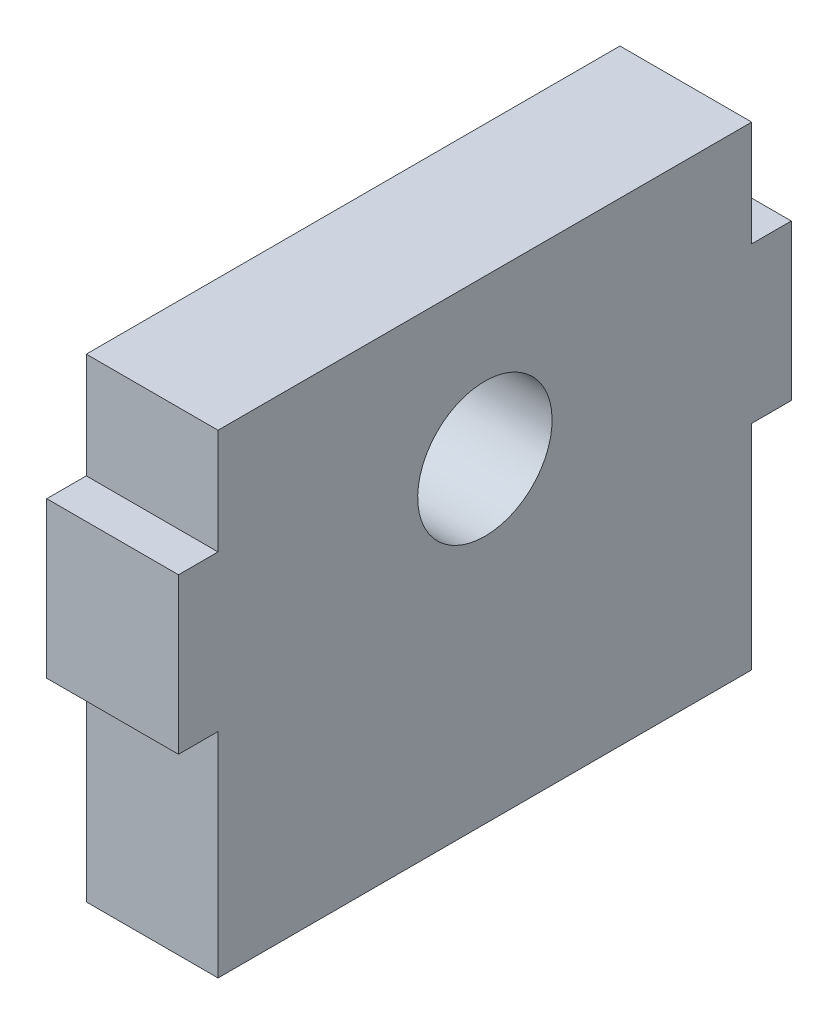
ISO-10303-21;
HEADER;
FILE_DESCRIPTION(('STEP AP214'),'2;1');
FILE_NAME('part.step','',(''),(''),'','','');
FILE_SCHEMA(('AUTOMOTIVE_DESIGN { 1 0 10303 214 1 1 1 1 }'));
ENDSEC;
DATA;
#1=APPLICATION_CONTEXT('core data for automotive mechanical design processes');
#2=APPLICATION_PROTOCOL_DEFINITION('international standard','automotive_design',2000,#1);
#3=PRODUCT_CONTEXT('',#1,'mechanical');
#4=PRODUCT('Part','Part','',(#3));
#5=PRODUCT_RELATED_PRODUCT_CATEGORY('part','',(#4));
#6=PRODUCT_DEFINITION_FORMATION('','',#4);
#7=PRODUCT_DEFINITION_CONTEXT('part definition',#1,'design');
#8=PRODUCT_DEFINITION('design','',#6,#7);
#9=PRODUCT_DEFINITION_SHAPE('','',#8);
#10=(LENGTH_UNIT() NAMED_UNIT(*) SI_UNIT(.MILLI.,.METRE.));
#11=(NAMED_UNIT(*) PLANE_ANGLE_UNIT() SI_UNIT($,.RADIAN.));
#12=(NAMED_UNIT(*) SI_UNIT($,.STERADIAN.) SOLID_ANGLE_UNIT());
#13=UNCERTAINTY_MEASURE_WITH_UNIT(LENGTH_MEASURE(1.E-05),#10,'distance_accuracy_value','');
#14=(GEOMETRIC_REPRESENTATION_CONTEXT(3) GLOBAL_UNCERTAINTY_ASSIGNED_CONTEXT((#13)) GLOBAL_UNIT_ASSIGNED_CONTEXT((#10,
#11,#12)) REPRESENTATION_CONTEXT('',''));
#15=CARTESIAN_POINT('',(0.,0.,0.));
#16=DIRECTION('',(0.,0.,1.));
#17=DIRECTION('',(1.,0.,0.));
#18=AXIS2_PLACEMENT_3D('',#15,#16,#17);
#19=CARTESIAN_POINT('',(-49.5,0.,48.5));
#20=DIRECTION('',(0.,0.,-1.));
#21=DIRECTION('',(0.,-1.,0.));
#22=AXIS2_PLACEMENT_3D('',#19,#20,#21);
#23=PLANE('',#22);
#24=DIRECTION('',(1.,0.,0.));
#25=VECTOR('',#24,1.);
#26=CARTESIAN_POINT('',(-49.5,-14.,48.5));
#27=LINE('',#26,#25);
#28=CARTESIAN_POINT('',(-59.5,-14.,48.5));
#29=VERTEX_POINT('',#28);
#30=CARTESIAN_POINT('',(-49.5,-14.,48.5));
#31=VERTEX_POINT('',#30);
#32=EDGE_CURVE('E11',#29,#31,#27,.T.);
#33=ORIENTED_EDGE('',*,*,#32,.F.);
#34=DIRECTION('',(0.,-1.,0.));
#35=VECTOR('',#34,1.);
#36=CARTESIAN_POINT('',(-59.5,0.,48.5));
#37=LINE('',#36,#35);
#38=CARTESIAN_POINT('',(-59.5,-25.8,48.5));
#39=VERTEX_POINT('',#38);
#40=EDGE_CURVE('E118',#29,#39,#37,.T.);
#41=ORIENTED_EDGE('',*,*,#40,.T.);
#42=DIRECTION('',(1.,0.,0.));
#43=VECTOR('',#42,1.);
#44=CARTESIAN_POINT('',(-49.5,-25.8,48.5));
#45=LINE('',#44,#43);
#46=CARTESIAN_POINT('',(-49.5,-25.8,48.5));
#47=VERTEX_POINT('',#46);
#48=EDGE_CURVE('E49',#39,#47,#45,.T.);
#49=ORIENTED_EDGE('',*,*,#48,.T.);
#50=DIRECTION('',(0.,-1.,0.));
#51=VECTOR('',#50,1.);
#52=CARTESIAN_POINT('',(-49.5,0.,48.5));
#53=LINE('',#52,#51);
#54=EDGE_CURVE('E182',#31,#47,#53,.T.);
#55=ORIENTED_EDGE('',*,*,#54,.F.);
#56=EDGE_LOOP('',(#33,#41,#49,#55));
#57=FACE_BOUND('',#56,.T.);
#58=ADVANCED_FACE('F39',(#57),#23,.F.);
#59=CARTESIAN_POINT('',(-49.5,-25.8,0.));
#60=DIRECTION('',(0.,-1.,0.));
#61=DIRECTION('',(0.,0.,1.));
#62=AXIS2_PLACEMENT_3D('',#59,#60,#61);
#63=PLANE('',#62);
#64=ORIENTED_EDGE('',*,*,#48,.F.);
#65=DIRECTION('',(0.,0.,1.));
#66=VECTOR('',#65,1.);
#67=CARTESIAN_POINT('',(-59.5,-25.8,0.));
#68=LINE('',#67,#66);
#69=CARTESIAN_POINT('',(-59.5,-25.8,45.5));
#70=VERTEX_POINT('',#69);
#71=EDGE_CURVE('E151',#70,#39,#68,.T.);
#72=ORIENTED_EDGE('',*,*,#71,.F.);
#73=DIRECTION('',(1.,0.,0.));
#74=VECTOR('',#73,1.);
#75=CARTESIAN_POINT('',(-49.5,-25.8,45.5));
#76=LINE('',#75,#74);
#77=CARTESIAN_POINT('',(-49.5,-25.8,45.5));
#78=VERTEX_POINT('',#77);
#79=EDGE_CURVE('E175',#70,#78,#76,.T.);
#80=ORIENTED_EDGE('',*,*,#79,.T.);
#81=DIRECTION('',(0.,0.,1.));
#82=VECTOR('',#81,1.);
#83=CARTESIAN_POINT('',(-49.5,-25.8,0.));
#84=LINE('',#83,#82);
#85=EDGE_CURVE('E192',#78,#47,#84,.T.);
#86=ORIENTED_EDGE('',*,*,#85,.T.);
#87=EDGE_LOOP('',(#64,#72,#80,#86));
#88=FACE_BOUND('',#87,.T.);
#89=ADVANCED_FACE('F195',(#88),#63,.T.);
#90=CARTESIAN_POINT('',(-49.5,0.,45.5));
#91=DIRECTION('',(0.,0.,-1.));
#92=DIRECTION('',(0.,-1.,0.));
#93=AXIS2_PLACEMENT_3D('',#90,#91,#92);
#94=PLANE('',#93);
#95=ORIENTED_EDGE('',*,*,#79,.F.);
#96=DIRECTION('',(0.,-1.,0.));
#97=VECTOR('',#96,1.);
#98=CARTESIAN_POINT('',(-59.5,0.,45.5));
#99=LINE('',#98,#97);
#100=CARTESIAN_POINT('',(-59.5,-42.,45.5));
#101=VERTEX_POINT('',#100);
#102=EDGE_CURVE('E148',#70,#101,#99,.T.);
#103=ORIENTED_EDGE('',*,*,#102,.T.);
#104=DIRECTION('',(1.,0.,0.));
#105=VECTOR('',#104,1.);
#106=CARTESIAN_POINT('',(-49.5,-42.,45.5));
#107=LINE('',#106,#105);
#108=CARTESIAN_POINT('',(-49.5,-42.,45.5));
#109=VERTEX_POINT('',#108);
#110=EDGE_CURVE('E172',#101,#109,#107,.T.);
#111=ORIENTED_EDGE('',*,*,#110,.T.);
#112=DIRECTION('',(0.,-1.,0.));
#113=VECTOR('',#112,1.);
#114=CARTESIAN_POINT('',(-49.5,0.,45.5));
#115=LINE('',#114,#113);
#116=EDGE_CURVE('E196',#78,#109,#115,.T.);
#117=ORIENTED_EDGE('',*,*,#116,.F.);
#118=EDGE_LOOP('',(#95,#103,#111,#117));
#119=FACE_BOUND('',#118,.T.);
#120=ADVANCED_FACE('F254',(#119),#94,.F.);
#121=CARTESIAN_POINT('',(-49.5,-42.,0.));
#122=DIRECTION('',(0.,-1.,0.));
#123=DIRECTION('',(0.,0.,1.));
#124=AXIS2_PLACEMENT_3D('',#121,#122,#123);
#125=PLANE('',#124);
#126=ORIENTED_EDGE('',*,*,#110,.F.);
#127=DIRECTION('',(0.,0.,1.));
#128=VECTOR('',#127,1.);
#129=CARTESIAN_POINT('',(-59.5,-42.,0.));
#130=LINE('',#129,#128);
#131=CARTESIAN_POINT('',(-59.5,-42.,5.));
#132=VERTEX_POINT('',#131);
#133=EDGE_CURVE('E145',#132,#101,#130,.T.);
#134=ORIENTED_EDGE('',*,*,#133,.F.);
#135=DIRECTION('',(1.,0.,0.));
#136=VECTOR('',#135,1.);
#137=CARTESIAN_POINT('',(-49.5,-42.,5.));
#138=LINE('',#137,#136);
#139=CARTESIAN_POINT('',(-49.5,-42.,5.));
#140=VERTEX_POINT('',#139);
#141=EDGE_CURVE('E169',#132,#140,#138,.T.);
#142=ORIENTED_EDGE('',*,*,#141,.T.);
#143=DIRECTION('',(0.,0.,1.));
#144=VECTOR('',#143,1.);
#145=CARTESIAN_POINT('',(-49.5,-42.,0.));
#146=LINE('',#145,#144);
#147=EDGE_CURVE('E198',#140,#109,#146,.T.);
#148=ORIENTED_EDGE('',*,*,#147,.T.);
#149=EDGE_LOOP('',(#126,#134,#142,#148));
#150=FACE_BOUND('',#149,.T.);
#151=ADVANCED_FACE('F258',(#150),#125,.T.);
#152=CARTESIAN_POINT('',(-49.5,0.,5.));
#153=DIRECTION('',(0.,0.,-1.));
#154=DIRECTION('',(0.,-1.,0.));
#155=AXIS2_PLACEMENT_3D('',#152,#153,#154);
#156=PLANE('',#155);
#157=ORIENTED_EDGE('',*,*,#141,.F.);
#158=DIRECTION('',(0.,-1.,0.));
#159=VECTOR('',#158,1.);
#160=CARTESIAN_POINT('',(-59.5,0.,5.));
#161=LINE('',#160,#159);
#162=CARTESIAN_POINT('',(-59.5,-25.8,5.));
#163=VERTEX_POINT('',#162);
#164=EDGE_CURVE('E142',#163,#132,#161,.T.);
#165=ORIENTED_EDGE('',*,*,#164,.F.);
#166=DIRECTION('',(1.,0.,0.));
#167=VECTOR('',#166,1.);
#168=CARTESIAN_POINT('',(-49.5,-25.8,5.));
#169=LINE('',#168,#167);
#170=CARTESIAN_POINT('',(-49.5,-25.8,5.));
#171=VERTEX_POINT('',#170);
#172=EDGE_CURVE('E166',#163,#171,#169,.T.);
#173=ORIENTED_EDGE('',*,*,#172,.T.);
#174=DIRECTION('',(0.,-1.,0.));
#175=VECTOR('',#174,1.);
#176=CARTESIAN_POINT('',(-49.5,0.,5.));
#177=LINE('',#176,#175);
#178=EDGE_CURVE('E205',#171,#140,#177,.T.);
#179=ORIENTED_EDGE('',*,*,#178,.T.);
#180=EDGE_LOOP('',(#157,#165,#173,#179));
#181=FACE_BOUND('',#180,.T.);
#182=ADVANCED_FACE('F259',(#181),#156,.T.);
#183=CARTESIAN_POINT('',(-49.5,-25.8,0.));
#184=DIRECTION('',(0.,1.,0.));
#185=DIRECTION('',(0.,0.,-1.));
#186=AXIS2_PLACEMENT_3D('',#183,#184,#185);
#187=PLANE('',#186);
#188=ORIENTED_EDGE('',*,*,#172,.F.);
#189=DIRECTION('',(0.,0.,1.));
#190=VECTOR('',#189,1.);
#191=CARTESIAN_POINT('',(-59.5,-25.8,0.));
#192=LINE('',#191,#190);
#193=CARTESIAN_POINT('',(-59.5,-25.8,2.));
#194=VERTEX_POINT('',#193);
#195=EDGE_CURVE('E139',#163,#194,#192,.F.);
#196=ORIENTED_EDGE('',*,*,#195,.T.);
#197=DIRECTION('',(1.,0.,0.));
#198=VECTOR('',#197,1.);
#199=CARTESIAN_POINT('',(-49.5,-25.8,2.));
#200=LINE('',#199,#198);
#201=CARTESIAN_POINT('',(-49.5,-25.8,2.));
#202=VERTEX_POINT('',#201);
#203=EDGE_CURVE('E163',#194,#202,#200,.T.);
#204=ORIENTED_EDGE('',*,*,#203,.T.);
#205=DIRECTION('',(0.,0.,-1.));
#206=VECTOR('',#205,1.);
#207=CARTESIAN_POINT('',(-49.5,-25.8,0.));
#208=LINE('',#207,#206);
#209=EDGE_CURVE('E208',#171,#202,#208,.T.);
#210=ORIENTED_EDGE('',*,*,#209,.F.);
#211=EDGE_LOOP('',(#188,#196,#204,#210));
#212=FACE_BOUND('',#211,.T.);
#213=ADVANCED_FACE('F241',(#212),#187,.F.);
#214=CARTESIAN_POINT('',(-49.5,0.,2.));
#215=DIRECTION('',(0.,0.,-1.));
#216=DIRECTION('',(0.,-1.,0.));
#217=AXIS2_PLACEMENT_3D('',#214,#215,#216);
#218=PLANE('',#217);
#219=ORIENTED_EDGE('',*,*,#203,.F.);
#220=DIRECTION('',(0.,-1.,0.));
#221=VECTOR('',#220,1.);
#222=CARTESIAN_POINT('',(-59.5,0.,2.));
#223=LINE('',#222,#221);
#224=CARTESIAN_POINT('',(-59.5,-14.,2.));
#225=VERTEX_POINT('',#224);
#226=EDGE_CURVE('E136',#225,#194,#223,.T.);
#227=ORIENTED_EDGE('',*,*,#226,.F.);
#228=DIRECTION('',(1.,0.,0.));
#229=VECTOR('',#228,1.);
#230=CARTESIAN_POINT('',(-49.5,-14.,2.));
#231=LINE('',#230,#229);
#232=CARTESIAN_POINT('',(-49.5,-14.,2.));
#233=VERTEX_POINT('',#232);
#234=EDGE_CURVE('E160',#225,#233,#231,.T.);
#235=ORIENTED_EDGE('',*,*,#234,.T.);
#236=DIRECTION('',(0.,-1.,0.));
#237=VECTOR('',#236,1.);
#238=CARTESIAN_POINT('',(-49.5,0.,2.));
#239=LINE('',#238,#237);
#240=EDGE_CURVE('E212',#233,#202,#239,.T.);
#241=ORIENTED_EDGE('',*,*,#240,.T.);
#242=EDGE_LOOP('',(#219,#227,#235,#241));
#243=FACE_BOUND('',#242,.T.);
#244=ADVANCED_FACE('F232',(#243),#218,.T.);
#245=CARTESIAN_POINT('',(-49.5,-14.,0.));
#246=DIRECTION('',(0.,1.,0.));
#247=DIRECTION('',(0.,0.,-1.));
#248=AXIS2_PLACEMENT_3D('',#245,#246,#247);
#249=PLANE('',#248);
#250=ORIENTED_EDGE('',*,*,#234,.F.);
#251=DIRECTION('',(0.,0.,1.));
#252=VECTOR('',#251,1.);
#253=CARTESIAN_POINT('',(-59.5,-14.,0.));
#254=LINE('',#253,#252);
#255=CARTESIAN_POINT('',(-59.5,-14.,5.));
#256=VERTEX_POINT('',#255);
#257=EDGE_CURVE('E133',#256,#225,#254,.F.);
#258=ORIENTED_EDGE('',*,*,#257,.F.);
#259=DIRECTION('',(1.,0.,0.));
#260=VECTOR('',#259,1.);
#261=CARTESIAN_POINT('',(-49.5,-14.,5.));
#262=LINE('',#261,#260);
#263=CARTESIAN_POINT('',(-49.5,-14.,5.));
#264=VERTEX_POINT('',#263);
#265=EDGE_CURVE('E157',#256,#264,#262,.T.);
#266=ORIENTED_EDGE('',*,*,#265,.T.);
#267=DIRECTION('',(0.,0.,-1.));
#268=VECTOR('',#267,1.);
#269=CARTESIAN_POINT('',(-49.5,-14.,0.));
#270=LINE('',#269,#268);
#271=EDGE_CURVE('E215',#264,#233,#270,.T.);
#272=ORIENTED_EDGE('',*,*,#271,.T.);
#273=EDGE_LOOP('',(#250,#258,#266,#272));
#274=FACE_BOUND('',#273,.T.);
#275=ADVANCED_FACE('F230',(#274),#249,.T.);
#276=ORIENTED_EDGE('',*,*,#265,.F.);
#277=DIRECTION('',(0.,-1.,0.));
#278=VECTOR('',#277,1.);
#279=CARTESIAN_POINT('',(-59.5,0.,5.));
#280=LINE('',#279,#278);
#281=CARTESIAN_POINT('',(-59.5,-6.00000000000001,5.));
#282=VERTEX_POINT('',#281);
#283=EDGE_CURVE('E130',#282,#256,#280,.T.);
#284=ORIENTED_EDGE('',*,*,#283,.F.);
#285=DIRECTION('',(1.,0.,0.));
#286=VECTOR('',#285,1.);
#287=CARTESIAN_POINT('',(-49.5,-6.00000000000001,5.));
#288=LINE('',#287,#286);
#289=CARTESIAN_POINT('',(-49.5,-6.00000000000001,5.));
#290=VERTEX_POINT('',#289);
#291=EDGE_CURVE('E155',#282,#290,#288,.T.);
#292=ORIENTED_EDGE('',*,*,#291,.T.);
#293=EDGE_CURVE('E209',#290,#264,#177,.T.);
#294=ORIENTED_EDGE('',*,*,#293,.T.);
#295=EDGE_LOOP('',(#276,#284,#292,#294));
#296=FACE_BOUND('',#295,.T.);
#297=ADVANCED_FACE('F221',(#296),#156,.T.);
#298=CARTESIAN_POINT('',(-49.5,-6.00000000000001,0.));
#299=DIRECTION('',(0.,-1.,0.));
#300=DIRECTION('',(0.,0.,1.));
#301=AXIS2_PLACEMENT_3D('',#298,#299,#300);
#302=PLANE('',#301);
#303=ORIENTED_EDGE('',*,*,#291,.F.);
#304=DIRECTION('',(0.,0.,1.));
#305=VECTOR('',#304,1.);
#306=CARTESIAN_POINT('',(-59.5,-6.00000000000001,0.));
#307=LINE('',#306,#305);
#308=CARTESIAN_POINT('',(-59.5,-6.00000000000001,45.5));
#309=VERTEX_POINT('',#308);
#310=EDGE_CURVE('E127',#282,#309,#307,.T.);
#311=ORIENTED_EDGE('',*,*,#310,.T.);
#312=DIRECTION('',(1.,0.,0.));
#313=VECTOR('',#312,1.);
#314=CARTESIAN_POINT('',(-49.5,-6.00000000000001,45.5));
#315=LINE('',#314,#313);
#316=CARTESIAN_POINT('',(-49.5,-6.00000000000001,45.5));
#317=VERTEX_POINT('',#316);
#318=EDGE_CURVE('E57',#309,#317,#315,.T.);
#319=ORIENTED_EDGE('',*,*,#318,.T.);
#320=DIRECTION('',(0.,0.,1.));
#321=VECTOR('',#320,1.);
#322=CARTESIAN_POINT('',(-49.5,-6.00000000000001,0.));
#323=LINE('',#322,#321);
#324=EDGE_CURVE('E111',#290,#317,#323,.T.);
#325=ORIENTED_EDGE('',*,*,#324,.F.);
#326=EDGE_LOOP('',(#303,#311,#319,#325));
#327=FACE_BOUND('',#326,.T.);
#328=ADVANCED_FACE('F226',(#327),#302,.F.);
#329=ORIENTED_EDGE('',*,*,#318,.F.);
#330=DIRECTION('',(0.,-1.,0.));
#331=VECTOR('',#330,1.);
#332=CARTESIAN_POINT('',(-59.5,0.,45.5));
#333=LINE('',#332,#331);
#334=CARTESIAN_POINT('',(-59.5,-14.,45.5));
#335=VERTEX_POINT('',#334);
#336=EDGE_CURVE('E116',#309,#335,#333,.T.);
#337=ORIENTED_EDGE('',*,*,#336,.T.);
#338=DIRECTION('',(1.,0.,0.));
#339=VECTOR('',#338,1.);
#340=CARTESIAN_POINT('',(-49.5,-14.,45.5));
#341=LINE('',#340,#339);
#342=CARTESIAN_POINT('',(-49.5,-14.,45.5));
#343=VERTEX_POINT('',#342);
#344=EDGE_CURVE('E43',#335,#343,#341,.T.);
#345=ORIENTED_EDGE('',*,*,#344,.T.);
#346=EDGE_CURVE('E200',#317,#343,#115,.T.);
#347=ORIENTED_EDGE('',*,*,#346,.F.);
#348=EDGE_LOOP('',(#329,#337,#345,#347));
#349=FACE_BOUND('',#348,.T.);
#350=ADVANCED_FACE('F120',(#349),#94,.F.);
#351=CARTESIAN_POINT('',(-49.5,-18.,25.25));
#352=DIRECTION('',(-1.,0.,0.));
#353=DIRECTION('',(0.,-1.,0.));
#354=AXIS2_PLACEMENT_3D('',#351,#352,#353);
#355=CYLINDRICAL_SURFACE('',#354,5.1);
#356=CARTESIAN_POINT('',(-49.5,-18.,25.25));
#357=DIRECTION('',(-1.,0.,0.));
#358=DIRECTION('',(0.,-1.,0.));
#359=AXIS2_PLACEMENT_3D('',#356,#357,#358);
#360=CIRCLE('',#359,5.1);
#361=CARTESIAN_POINT('',(-49.5,-23.1,25.25));
#362=VERTEX_POINT('',#361);
#363=EDGE_CURVE('E129',#362,#362,#360,.T.);
#364=ORIENTED_EDGE('',*,*,#363,.F.);
#365=EDGE_LOOP('',(#364));
#366=FACE_BOUND('',#365,.T.);
#367=CARTESIAN_POINT('',(-59.5,-18.,25.25));
#368=DIRECTION('',(-1.,0.,0.));
#369=DIRECTION('',(0.,-1.,0.));
#370=AXIS2_PLACEMENT_3D('',#367,#368,#369);
#371=CIRCLE('',#370,5.1);
#372=CARTESIAN_POINT('',(-59.5,-23.1,25.25));
#373=VERTEX_POINT('',#372);
#374=EDGE_CURVE('E121',#373,#373,#371,.T.);
#375=ORIENTED_EDGE('',*,*,#374,.T.);
#376=EDGE_LOOP('',(#375));
#377=FACE_BOUND('',#376,.T.);
#378=ADVANCED_FACE('F298',(#366,#377),#355,.F.);
#379=CARTESIAN_POINT('',(-49.5,-14.,0.));
#380=DIRECTION('',(0.,-1.,0.));
#381=DIRECTION('',(0.,0.,1.));
#382=AXIS2_PLACEMENT_3D('',#379,#380,#381);
#383=PLANE('',#382);
#384=DIRECTION('',(0.,0.,1.));
#385=VECTOR('',#384,1.);
#386=CARTESIAN_POINT('',(-59.5,-14.,0.));
#387=LINE('',#386,#385);
#388=EDGE_CURVE('E105',#335,#29,#387,.T.);
#389=ORIENTED_EDGE('',*,*,#388,.T.);
#390=ORIENTED_EDGE('',*,*,#32,.T.);
#391=DIRECTION('',(0.,0.,1.));
#392=VECTOR('',#391,1.);
#393=CARTESIAN_POINT('',(-49.5,-14.,0.));
#394=LINE('',#393,#392);
#395=EDGE_CURVE('E107',#343,#31,#394,.T.);
#396=ORIENTED_EDGE('',*,*,#395,.F.);
#397=ORIENTED_EDGE('',*,*,#344,.F.);
#398=EDGE_LOOP('',(#389,#390,#396,#397));
#399=FACE_BOUND('',#398,.T.);
#400=ADVANCED_FACE('F41',(#399),#383,.F.);
#401=CARTESIAN_POINT('',(-49.5,0.,0.));
#402=DIRECTION('',(-1.,0.,0.));
#403=DIRECTION('',(0.,-1.,0.));
#404=AXIS2_PLACEMENT_3D('',#401,#402,#403);
#405=PLANE('',#404);
#406=ORIENTED_EDGE('',*,*,#363,.T.);
#407=EDGE_LOOP('',(#406));
#408=FACE_BOUND('',#407,.T.);
#409=ORIENTED_EDGE('',*,*,#346,.T.);
#410=ORIENTED_EDGE('',*,*,#395,.T.);
#411=ORIENTED_EDGE('',*,*,#54,.T.);
#412=ORIENTED_EDGE('',*,*,#85,.F.);
#413=ORIENTED_EDGE('',*,*,#116,.T.);
#414=ORIENTED_EDGE('',*,*,#147,.F.);
#415=ORIENTED_EDGE('',*,*,#178,.F.);
#416=ORIENTED_EDGE('',*,*,#209,.T.);
#417=ORIENTED_EDGE('',*,*,#240,.F.);
#418=ORIENTED_EDGE('',*,*,#271,.F.);
#419=ORIENTED_EDGE('',*,*,#293,.F.);
#420=ORIENTED_EDGE('',*,*,#324,.T.);
#421=EDGE_LOOP('',(#409,#410,#411,#412,#413,#414,#415,#416,#417,#418,#419,#420));
#422=FACE_BOUND('',#421,.T.);
#423=ADVANCED_FACE('F190',(#408,#422),#405,.F.);
#424=CARTESIAN_POINT('',(-59.5,0.,0.));
#425=DIRECTION('',(-1.,0.,0.));
#426=DIRECTION('',(0.,-1.,0.));
#427=AXIS2_PLACEMENT_3D('',#424,#425,#426);
#428=PLANE('',#427);
#429=ORIENTED_EDGE('',*,*,#374,.F.);
#430=EDGE_LOOP('',(#429));
#431=FACE_BOUND('',#430,.T.);
#432=ORIENTED_EDGE('',*,*,#336,.F.);
#433=ORIENTED_EDGE('',*,*,#310,.F.);
#434=ORIENTED_EDGE('',*,*,#283,.T.);
#435=ORIENTED_EDGE('',*,*,#257,.T.);
#436=ORIENTED_EDGE('',*,*,#226,.T.);
#437=ORIENTED_EDGE('',*,*,#195,.F.);
#438=ORIENTED_EDGE('',*,*,#164,.T.);
#439=ORIENTED_EDGE('',*,*,#133,.T.);
#440=ORIENTED_EDGE('',*,*,#102,.F.);
#441=ORIENTED_EDGE('',*,*,#71,.T.);
#442=ORIENTED_EDGE('',*,*,#40,.F.);
#443=ORIENTED_EDGE('',*,*,#388,.F.);
#444=EDGE_LOOP('',(#432,#433,#434,#435,#436,#437,#438,#439,#440,#441,#442,#443));
#445=FACE_BOUND('',#444,.T.);
#446=ADVANCED_FACE('F114',(#431,#445),#428,.T.);
#447=CLOSED_SHELL('',(#58,#89,#120,#151,#182,#213,#244,#275,#297,#328,#350,#378,#400,#423,#446));
#448=MANIFOLD_SOLID_BREP('B2',#447);
#449=ADVANCED_BREP_SHAPE_REPRESENTATION('',(#18,#448),#14);
#450=SHAPE_DEFINITION_REPRESENTATION(#9,#449);
ENDSEC;
END-ISO-10303-21;
